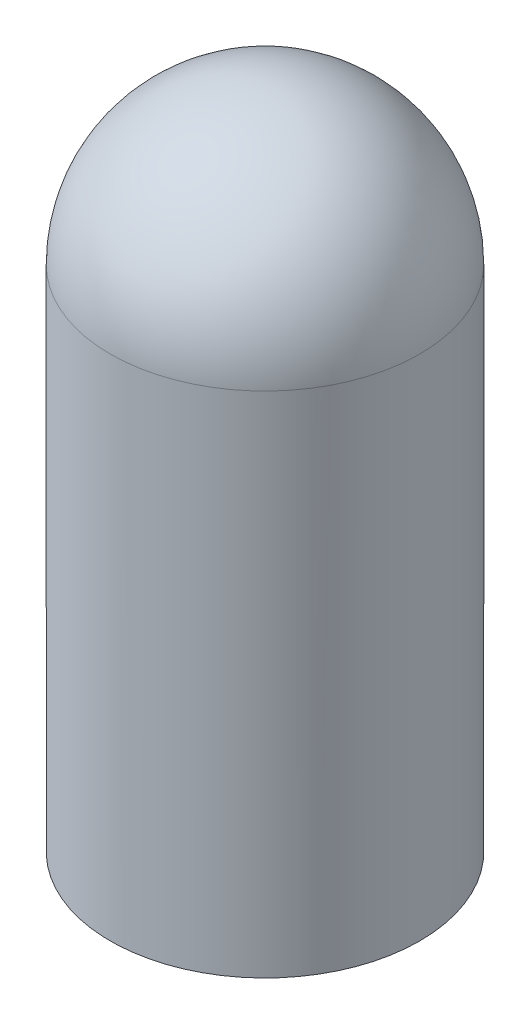
ISO-10303-21;
HEADER;
FILE_DESCRIPTION(('STEP AP214'),'2;1');
FILE_NAME('part.step','',(''),(''),'','','');
FILE_SCHEMA(('AUTOMOTIVE_DESIGN { 1 0 10303 214 1 1 1 1 }'));
ENDSEC;
DATA;
#1=APPLICATION_CONTEXT('core data for automotive mechanical design processes');
#2=APPLICATION_PROTOCOL_DEFINITION('international standard','automotive_design',2000,#1);
#3=PRODUCT_CONTEXT('',#1,'mechanical');
#4=PRODUCT('Part','Part','',(#3));
#5=PRODUCT_RELATED_PRODUCT_CATEGORY('part','',(#4));
#6=PRODUCT_DEFINITION_FORMATION('','',#4);
#7=PRODUCT_DEFINITION_CONTEXT('part definition',#1,'design');
#8=PRODUCT_DEFINITION('design','',#6,#7);
#9=PRODUCT_DEFINITION_SHAPE('','',#8);
#10=(LENGTH_UNIT() NAMED_UNIT(*) SI_UNIT(.MILLI.,.METRE.));
#11=(NAMED_UNIT(*) PLANE_ANGLE_UNIT() SI_UNIT($,.RADIAN.));
#12=(NAMED_UNIT(*) SI_UNIT($,.STERADIAN.) SOLID_ANGLE_UNIT());
#13=UNCERTAINTY_MEASURE_WITH_UNIT(LENGTH_MEASURE(1.E-05),#10,'distance_accuracy_value','');
#14=(GEOMETRIC_REPRESENTATION_CONTEXT(3) GLOBAL_UNCERTAINTY_ASSIGNED_CONTEXT((#13)) GLOBAL_UNIT_ASSIGNED_CONTEXT((#10,
#11,#12)) REPRESENTATION_CONTEXT('',''));
#15=CARTESIAN_POINT('',(0.,0.,0.));
#16=DIRECTION('',(0.,0.,1.));
#17=DIRECTION('',(1.,0.,0.));
#18=AXIS2_PLACEMENT_3D('',#15,#16,#17);
#19=CARTESIAN_POINT('',(-21.,-2.,0.));
#20=DIRECTION('',(0.,1.,0.));
#21=DIRECTION('',(1.,0.,0.));
#22=AXIS2_PLACEMENT_3D('',#19,#20,#21);
#23=PLANE('',#22);
#24=CARTESIAN_POINT('',(-21.,-2.,0.));
#25=DIRECTION('',(0.,1.,0.));
#26=DIRECTION('',(1.,0.,0.));
#27=AXIS2_PLACEMENT_3D('',#24,#25,#26);
#28=CIRCLE('',#27,10.4);
#29=CARTESIAN_POINT('',(-31.4,-2.,0.));
#30=VERTEX_POINT('',#29);
#31=EDGE_CURVE('E80',#30,#30,#28,.T.);
#32=ORIENTED_EDGE('',*,*,#31,.T.);
#33=EDGE_LOOP('',(#32));
#34=FACE_BOUND('',#33,.T.);
#35=CARTESIAN_POINT('',(-21.,-2.,0.));
#36=DIRECTION('',(0.,1.,0.));
#37=DIRECTION('',(1.,0.,0.));
#38=AXIS2_PLACEMENT_3D('',#35,#36,#37);
#39=CIRCLE('',#38,14.);
#40=CARTESIAN_POINT('',(-35.,-2.,0.));
#41=VERTEX_POINT('',#40);
#42=EDGE_CURVE('E10',#41,#41,#39,.T.);
#43=ORIENTED_EDGE('',*,*,#42,.F.);
#44=EDGE_LOOP('',(#43));
#45=FACE_BOUND('',#44,.T.);
#46=ADVANCED_FACE('F15',(#34,#45),#23,.F.);
#47=CARTESIAN_POINT('',(-21.,0.,0.));
#48=DIRECTION('',(0.,1.,0.));
#49=DIRECTION('',(1.,0.,0.));
#50=AXIS2_PLACEMENT_3D('',#47,#48,#49);
#51=CYLINDRICAL_SURFACE('',#50,14.);
#52=CARTESIAN_POINT('',(-21.,44.,0.));
#53=DIRECTION('',(0.,1.,0.));
#54=DIRECTION('',(1.,0.,0.));
#55=AXIS2_PLACEMENT_3D('',#52,#53,#54);
#56=CIRCLE('',#55,14.);
#57=CARTESIAN_POINT('',(-35.,44.,0.));
#58=VERTEX_POINT('',#57);
#59=CARTESIAN_POINT('',(-21.,44.,14.));
#60=VERTEX_POINT('',#59);
#61=EDGE_CURVE('E65',#58,#60,#56,.T.);
#62=ORIENTED_EDGE('',*,*,#61,.F.);
#63=DIRECTION('',(0.,-1.,0.));
#64=VECTOR('',#63,1.);
#65=CARTESIAN_POINT('',(-35.,0.,0.));
#66=LINE('',#65,#64);
#67=EDGE_CURVE('E26',#58,#41,#66,.T.);
#68=ORIENTED_EDGE('',*,*,#67,.T.);
#69=ORIENTED_EDGE('',*,*,#42,.T.);
#70=ORIENTED_EDGE('',*,*,#67,.F.);
#71=CARTESIAN_POINT('',(-21.,44.,0.));
#72=DIRECTION('',(0.,1.,0.));
#73=DIRECTION('',(1.,0.,0.));
#74=AXIS2_PLACEMENT_3D('',#71,#72,#73);
#75=CIRCLE('',#74,14.);
#76=EDGE_CURVE('E19',#60,#58,#75,.T.);
#77=ORIENTED_EDGE('',*,*,#76,.F.);
#78=EDGE_LOOP('',(#62,#68,#69,#70,#77));
#79=FACE_BOUND('',#78,.T.);
#80=ADVANCED_FACE('F63',(#79),#51,.T.);
#81=CARTESIAN_POINT('',(-21.,44.,0.));
#82=DIRECTION('',(0.,1.,0.));
#83=DIRECTION('',(0.,0.,-1.));
#84=AXIS2_PLACEMENT_3D('',#81,#82,#83);
#85=SPHERICAL_SURFACE('',#84,14.);
#86=ORIENTED_EDGE('',*,*,#61,.T.);
#87=CARTESIAN_POINT('',(-21.,44.,0.));
#88=DIRECTION('',(1.,0.,0.));
#89=DIRECTION('',(0.,0.,1.));
#90=AXIS2_PLACEMENT_3D('',#87,#88,#89);
#91=CIRCLE('',#90,14.);
#92=CARTESIAN_POINT('',(-21.,58.,0.));
#93=VERTEX_POINT('',#92);
#94=EDGE_CURVE('E68',#93,#60,#91,.T.);
#95=ORIENTED_EDGE('',*,*,#94,.F.);
#96=ORIENTED_EDGE('',*,*,#94,.T.);
#97=ORIENTED_EDGE('',*,*,#76,.T.);
#98=EDGE_LOOP('',(#86,#95,#96,#97));
#99=FACE_BOUND('',#98,.T.);
#100=ADVANCED_FACE('F69',(#99),#85,.T.);
#101=CARTESIAN_POINT('',(-21.,0.,0.));
#102=DIRECTION('',(0.,1.,0.));
#103=DIRECTION('',(1.,0.,0.));
#104=AXIS2_PLACEMENT_3D('',#101,#102,#103);
#105=CYLINDRICAL_SURFACE('',#104,10.4);
#106=ORIENTED_EDGE('',*,*,#31,.F.);
#107=DIRECTION('',(0.,1.,0.));
#108=VECTOR('',#107,1.);
#109=CARTESIAN_POINT('',(-31.4,0.,0.));
#110=LINE('',#109,#108);
#111=CARTESIAN_POINT('',(-31.4,44.,0.));
#112=VERTEX_POINT('',#111);
#113=EDGE_CURVE('E73',#30,#112,#110,.T.);
#114=ORIENTED_EDGE('',*,*,#113,.T.);
#115=CARTESIAN_POINT('',(-21.,44.,0.));
#116=DIRECTION('',(0.,1.,0.));
#117=DIRECTION('',(1.,0.,0.));
#118=AXIS2_PLACEMENT_3D('',#115,#116,#117);
#119=CIRCLE('',#118,10.4);
#120=CARTESIAN_POINT('',(-21.,44.,10.4));
#121=VERTEX_POINT('',#120);
#122=EDGE_CURVE('E88',#112,#121,#119,.T.);
#123=ORIENTED_EDGE('',*,*,#122,.T.);
#124=CARTESIAN_POINT('',(-21.,44.,0.));
#125=DIRECTION('',(0.,1.,0.));
#126=DIRECTION('',(1.,0.,0.));
#127=AXIS2_PLACEMENT_3D('',#124,#125,#126);
#128=CIRCLE('',#127,10.4);
#129=EDGE_CURVE('E85',#121,#112,#128,.T.);
#130=ORIENTED_EDGE('',*,*,#129,.T.);
#131=ORIENTED_EDGE('',*,*,#113,.F.);
#132=EDGE_LOOP('',(#106,#114,#123,#130,#131));
#133=FACE_BOUND('',#132,.T.);
#134=ADVANCED_FACE('F108',(#133),#105,.F.);
#135=CARTESIAN_POINT('',(-21.,44.,0.));
#136=DIRECTION('',(0.,1.,0.));
#137=DIRECTION('',(0.,0.,-1.));
#138=AXIS2_PLACEMENT_3D('',#135,#136,#137);
#139=SPHERICAL_SURFACE('',#138,10.4);
#140=ORIENTED_EDGE('',*,*,#122,.F.);
#141=ORIENTED_EDGE('',*,*,#129,.F.);
#142=CARTESIAN_POINT('',(-21.,44.,0.));
#143=DIRECTION('',(-1.,0.,0.));
#144=DIRECTION('',(0.,0.,1.));
#145=AXIS2_PLACEMENT_3D('',#142,#143,#144);
#146=CIRCLE('',#145,10.4);
#147=CARTESIAN_POINT('',(-21.,54.4,0.));
#148=VERTEX_POINT('',#147);
#149=EDGE_CURVE('E83',#121,#148,#146,.T.);
#150=ORIENTED_EDGE('',*,*,#149,.T.);
#151=ORIENTED_EDGE('',*,*,#149,.F.);
#152=EDGE_LOOP('',(#140,#141,#150,#151));
#153=FACE_BOUND('',#152,.T.);
#154=ADVANCED_FACE('F17',(#153),#139,.F.);
#155=CLOSED_SHELL('',(#46,#80,#100,#134,#154));
#156=MANIFOLD_SOLID_BREP('B1',#155);
#157=ADVANCED_BREP_SHAPE_REPRESENTATION('',(#18,#156),#14);
#158=SHAPE_DEFINITION_REPRESENTATION(#9,#157);
ENDSEC;
END-ISO-10303-21;
